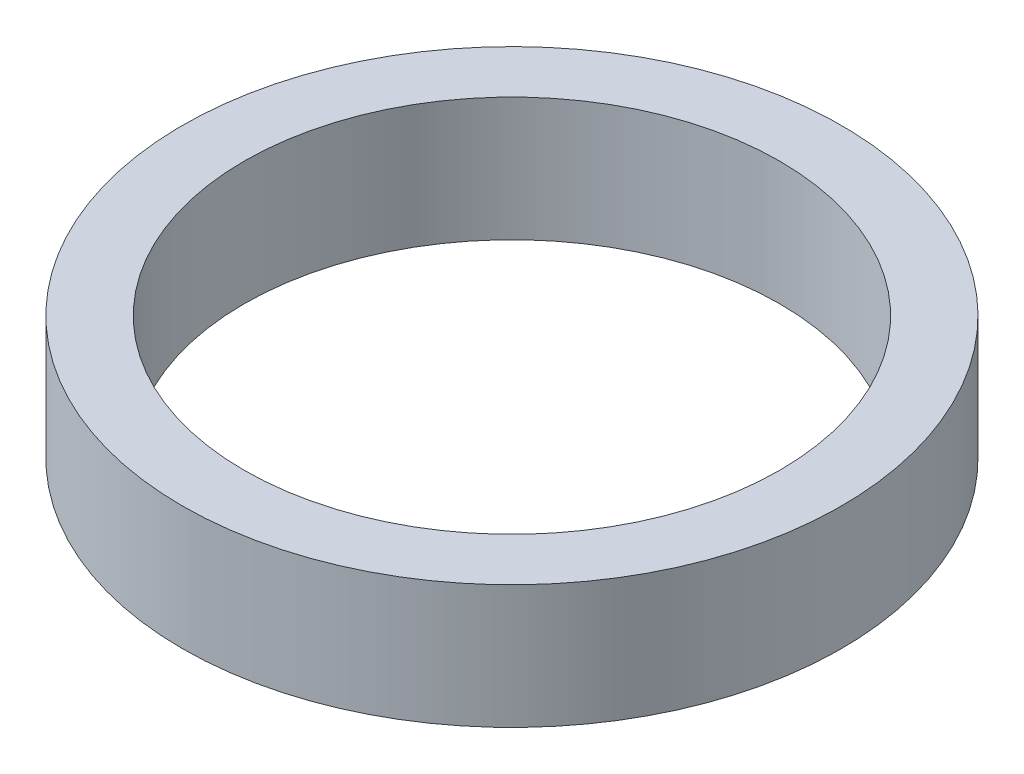
ISO-10303-21;
HEADER;
FILE_DESCRIPTION(('STEP AP214'),'2;1');
FILE_NAME('part.step','',(''),(''),'','','');
FILE_SCHEMA(('AUTOMOTIVE_DESIGN { 1 0 10303 214 1 1 1 1 }'));
ENDSEC;
DATA;
#1=APPLICATION_CONTEXT('core data for automotive mechanical design processes');
#2=APPLICATION_PROTOCOL_DEFINITION('international standard','automotive_design',2000,#1);
#3=PRODUCT_CONTEXT('',#1,'mechanical');
#4=PRODUCT('Part','Part','',(#3));
#5=PRODUCT_RELATED_PRODUCT_CATEGORY('part','',(#4));
#6=PRODUCT_DEFINITION_FORMATION('','',#4);
#7=PRODUCT_DEFINITION_CONTEXT('part definition',#1,'design');
#8=PRODUCT_DEFINITION('design','',#6,#7);
#9=PRODUCT_DEFINITION_SHAPE('','',#8);
#10=(LENGTH_UNIT() NAMED_UNIT(*) SI_UNIT(.MILLI.,.METRE.));
#11=(NAMED_UNIT(*) PLANE_ANGLE_UNIT() SI_UNIT($,.RADIAN.));
#12=(NAMED_UNIT(*) SI_UNIT($,.STERADIAN.) SOLID_ANGLE_UNIT());
#13=UNCERTAINTY_MEASURE_WITH_UNIT(LENGTH_MEASURE(1.E-05),#10,'distance_accuracy_value','');
#14=(GEOMETRIC_REPRESENTATION_CONTEXT(3) GLOBAL_UNCERTAINTY_ASSIGNED_CONTEXT((#13)) GLOBAL_UNIT_ASSIGNED_CONTEXT((#10,
#11,#12)) REPRESENTATION_CONTEXT('',''));
#15=CARTESIAN_POINT('',(0.,0.,0.));
#16=DIRECTION('',(0.,0.,1.));
#17=DIRECTION('',(1.,0.,0.));
#18=AXIS2_PLACEMENT_3D('',#15,#16,#17);
#19=CARTESIAN_POINT('',(0.,15.,0.));
#20=DIRECTION('',(0.,-1.,0.));
#21=DIRECTION('',(0.,0.,-1.));
#22=AXIS2_PLACEMENT_3D('',#19,#20,#21);
#23=CYLINDRICAL_SURFACE('',#22,40.);
#24=CARTESIAN_POINT('',(0.,15.,0.));
#25=DIRECTION('',(0.,1.,0.));
#26=DIRECTION('',(0.,0.,1.));
#27=AXIS2_PLACEMENT_3D('',#24,#25,#26);
#28=CIRCLE('',#27,40.);
#29=CARTESIAN_POINT('',(0.,15.,40.));
#30=VERTEX_POINT('',#29);
#31=EDGE_CURVE('E10',#30,#30,#28,.T.);
#32=ORIENTED_EDGE('',*,*,#31,.F.);
#33=EDGE_LOOP('',(#32));
#34=FACE_BOUND('',#33,.T.);
#35=CARTESIAN_POINT('',(0.,0.,0.));
#36=DIRECTION('',(0.,1.,0.));
#37=DIRECTION('',(0.,0.,1.));
#38=AXIS2_PLACEMENT_3D('',#35,#36,#37);
#39=CIRCLE('',#38,40.);
#40=CARTESIAN_POINT('',(0.,0.,40.));
#41=VERTEX_POINT('',#40);
#42=EDGE_CURVE('E37',#41,#41,#39,.T.);
#43=ORIENTED_EDGE('',*,*,#42,.T.);
#44=EDGE_LOOP('',(#43));
#45=FACE_BOUND('',#44,.T.);
#46=ADVANCED_FACE('F40',(#34,#45),#23,.T.);
#47=CARTESIAN_POINT('',(0.,15.,0.));
#48=DIRECTION('',(0.,1.,0.));
#49=DIRECTION('',(0.,0.,1.));
#50=AXIS2_PLACEMENT_3D('',#47,#48,#49);
#51=PLANE('',#50);
#52=CARTESIAN_POINT('',(0.,15.,0.));
#53=DIRECTION('',(0.,1.,0.));
#54=DIRECTION('',(0.,0.,1.));
#55=AXIS2_PLACEMENT_3D('',#52,#53,#54);
#56=CIRCLE('',#55,32.5);
#57=CARTESIAN_POINT('',(0.,15.,32.5));
#58=VERTEX_POINT('',#57);
#59=EDGE_CURVE('E50',#58,#58,#56,.T.);
#60=ORIENTED_EDGE('',*,*,#59,.F.);
#61=EDGE_LOOP('',(#60));
#62=FACE_BOUND('',#61,.T.);
#63=ORIENTED_EDGE('',*,*,#31,.T.);
#64=EDGE_LOOP('',(#63));
#65=FACE_BOUND('',#64,.T.);
#66=ADVANCED_FACE('F59',(#62,#65),#51,.T.);
#67=CARTESIAN_POINT('',(0.,0.,0.));
#68=DIRECTION('',(0.,1.,0.));
#69=DIRECTION('',(0.,0.,1.));
#70=AXIS2_PLACEMENT_3D('',#67,#68,#69);
#71=PLANE('',#70);
#72=CARTESIAN_POINT('',(0.,0.,0.));
#73=DIRECTION('',(0.,1.,0.));
#74=DIRECTION('',(0.,0.,1.));
#75=AXIS2_PLACEMENT_3D('',#72,#73,#74);
#76=CIRCLE('',#75,32.5);
#77=CARTESIAN_POINT('',(0.,0.,32.5));
#78=VERTEX_POINT('',#77);
#79=EDGE_CURVE('E47',#78,#78,#76,.T.);
#80=ORIENTED_EDGE('',*,*,#79,.T.);
#81=EDGE_LOOP('',(#80));
#82=FACE_BOUND('',#81,.T.);
#83=ORIENTED_EDGE('',*,*,#42,.F.);
#84=EDGE_LOOP('',(#83));
#85=FACE_BOUND('',#84,.T.);
#86=ADVANCED_FACE('F58',(#82,#85),#71,.F.);
#87=CARTESIAN_POINT('',(0.,15.,0.));
#88=DIRECTION('',(0.,-1.,0.));
#89=DIRECTION('',(0.,0.,-1.));
#90=AXIS2_PLACEMENT_3D('',#87,#88,#89);
#91=CYLINDRICAL_SURFACE('',#90,32.5);
#92=ORIENTED_EDGE('',*,*,#59,.T.);
#93=EDGE_LOOP('',(#92));
#94=FACE_BOUND('',#93,.T.);
#95=ORIENTED_EDGE('',*,*,#79,.F.);
#96=EDGE_LOOP('',(#95));
#97=FACE_BOUND('',#96,.T.);
#98=ADVANCED_FACE('F54',(#94,#97),#91,.F.);
#99=CLOSED_SHELL('',(#46,#66,#86,#98));
#100=MANIFOLD_SOLID_BREP('B2',#99);
#101=ADVANCED_BREP_SHAPE_REPRESENTATION('',(#18,#100),#14);
#102=SHAPE_DEFINITION_REPRESENTATION(#9,#101);
ENDSEC;
END-ISO-10303-21;
